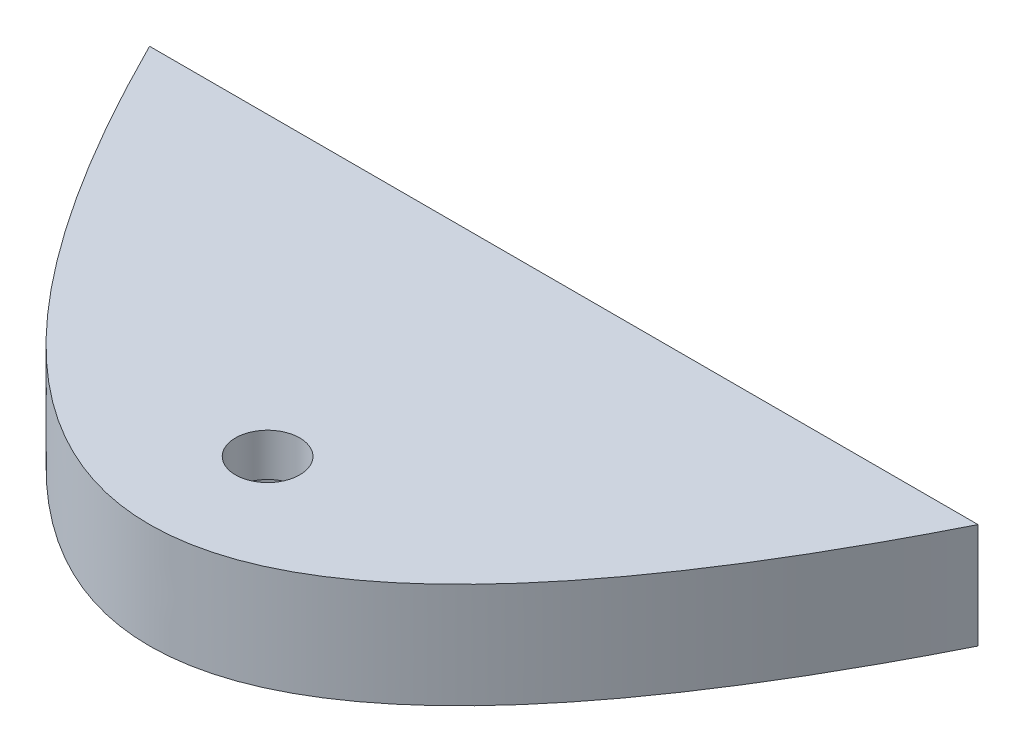
ISO-10303-21;
HEADER;
FILE_DESCRIPTION(('STEP AP214'),'2;1');
FILE_NAME('part.step','',(''),(''),'','','');
FILE_SCHEMA(('AUTOMOTIVE_DESIGN { 1 0 10303 214 1 1 1 1 }'));
ENDSEC;
DATA;
#1=APPLICATION_CONTEXT('core data for automotive mechanical design processes');
#2=APPLICATION_PROTOCOL_DEFINITION('international standard','automotive_design',2000,#1);
#3=PRODUCT_CONTEXT('',#1,'mechanical');
#4=PRODUCT('Part','Part','',(#3));
#5=PRODUCT_RELATED_PRODUCT_CATEGORY('part','',(#4));
#6=PRODUCT_DEFINITION_FORMATION('','',#4);
#7=PRODUCT_DEFINITION_CONTEXT('part definition',#1,'design');
#8=PRODUCT_DEFINITION('design','',#6,#7);
#9=PRODUCT_DEFINITION_SHAPE('','',#8);
#10=(LENGTH_UNIT() NAMED_UNIT(*) SI_UNIT(.MILLI.,.METRE.));
#11=(NAMED_UNIT(*) PLANE_ANGLE_UNIT() SI_UNIT($,.RADIAN.));
#12=(NAMED_UNIT(*) SI_UNIT($,.STERADIAN.) SOLID_ANGLE_UNIT());
#13=UNCERTAINTY_MEASURE_WITH_UNIT(LENGTH_MEASURE(1.E-05),#10,'distance_accuracy_value','');
#14=(GEOMETRIC_REPRESENTATION_CONTEXT(3) GLOBAL_UNCERTAINTY_ASSIGNED_CONTEXT((#13)) GLOBAL_UNIT_ASSIGNED_CONTEXT((#10,
#11,#12)) REPRESENTATION_CONTEXT('',''));
#15=CARTESIAN_POINT('',(0.,0.,0.));
#16=DIRECTION('',(0.,0.,1.));
#17=DIRECTION('',(1.,0.,0.));
#18=AXIS2_PLACEMENT_3D('',#15,#16,#17);
#19=CARTESIAN_POINT('',(0.,173.,142.999999999465));
#20=DIRECTION('',(0.,-1.,0.));
#21=DIRECTION('',(0.,0.,-1.));
#22=AXIS2_PLACEMENT_3D('',#19,#20,#21);
#23=CYLINDRICAL_SURFACE('',#22,15.5);
#24=CARTESIAN_POINT('',(0.,147.6,142.999999999465));
#25=DIRECTION('',(0.,-1.,0.));
#26=DIRECTION('',(0.,0.,-1.));
#27=AXIS2_PLACEMENT_3D('',#24,#25,#26);
#28=CIRCLE('',#27,15.5);
#29=CARTESIAN_POINT('',(0.,147.6,127.499999999465));
#30=VERTEX_POINT('',#29);
#31=EDGE_CURVE('E75',#30,#30,#28,.T.);
#32=ORIENTED_EDGE('',*,*,#31,.F.);
#33=EDGE_LOOP('',(#32));
#34=FACE_BOUND('',#33,.T.);
#35=CARTESIAN_POINT('',(0.,127.,142.999999999465));
#36=DIRECTION('',(0.,-1.,0.));
#37=DIRECTION('',(0.,0.,-1.));
#38=AXIS2_PLACEMENT_3D('',#35,#36,#37);
#39=CIRCLE('',#38,15.5);
#40=CARTESIAN_POINT('',(0.,127.,127.499999999465));
#41=VERTEX_POINT('',#40);
#42=EDGE_CURVE('E90',#41,#41,#39,.T.);
#43=ORIENTED_EDGE('',*,*,#42,.T.);
#44=EDGE_LOOP('',(#43));
#45=FACE_BOUND('',#44,.T.);
#46=ADVANCED_FACE('F35',(#34,#45),#23,.F.);
#47=CARTESIAN_POINT('',(-200.000000000337,300.,-6.70196537155832E-10));
#48=CARTESIAN_POINT('',(-5.91540705308091E-11,300.,400.000000000552));
#49=CARTESIAN_POINT('',(200.000000000219,300.,-4.34305369445553E-10));
#50=B_SPLINE_CURVE_WITH_KNOTS('',2,(#47,#48,#49),.UNSPECIFIED.,.F.,.F.,(3,3),(0.056028396232078,
0.943971603767659),.UNSPECIFIED.);
#51=DIRECTION('',(0.,-1.,0.));
#52=VECTOR('',#51,1.);
#53=SURFACE_OF_LINEAR_EXTRUSION('',#50,#52);
#54=DIRECTION('',(0.,-1.,0.));
#55=VECTOR('',#54,1.);
#56=CARTESIAN_POINT('',(-200.00000000027,300.,-5.35238059385865E-10));
#57=LINE('',#56,#55);
#58=CARTESIAN_POINT('',(-200.00000000027,147.6,0.));
#59=VERTEX_POINT('',#58);
#60=CARTESIAN_POINT('',(-200.00000000027,96.8,-5.35238059385865E-10));
#61=VERTEX_POINT('',#60);
#62=EDGE_CURVE('E45',#59,#61,#57,.T.);
#63=ORIENTED_EDGE('',*,*,#62,.T.);
#64=CARTESIAN_POINT('',(-200.000000000337,96.8000000000001,-6.70196537155832E-10));
#65=CARTESIAN_POINT('',(-5.91540705308091E-11,96.8000000000001,400.000000000552));
#66=CARTESIAN_POINT('',(200.000000000219,96.8000000000001,-4.34305369445553E-10));
#67=B_SPLINE_CURVE_WITH_KNOTS('',2,(#64,#65,#66),.UNSPECIFIED.,.F.,.F.,(3,3),(0.056028396232078,
0.943971603767659),.UNSPECIFIED.);
#68=CARTESIAN_POINT('',(200.000000000156,96.8,0.));
#69=VERTEX_POINT('',#68);
#70=EDGE_CURVE('E51',#61,#69,#67,.T.);
#71=ORIENTED_EDGE('',*,*,#70,.T.);
#72=DIRECTION('',(0.,-1.,0.));
#73=VECTOR('',#72,1.);
#74=CARTESIAN_POINT('',(200.000000000156,300.,-5.35238059385865E-10));
#75=LINE('',#74,#73);
#76=CARTESIAN_POINT('',(200.000000000156,147.6,-5.35238059385865E-10));
#77=VERTEX_POINT('',#76);
#78=EDGE_CURVE('E11',#77,#69,#75,.T.);
#79=ORIENTED_EDGE('',*,*,#78,.F.);
#80=CARTESIAN_POINT('',(-200.000000000337,147.6,-6.70196537155832E-10));
#81=CARTESIAN_POINT('',(-5.91540705308091E-11,147.6,400.000000000552));
#82=CARTESIAN_POINT('',(200.000000000219,147.6,-4.34305369445553E-10));
#83=B_SPLINE_CURVE_WITH_KNOTS('',2,(#80,#81,#82),.UNSPECIFIED.,.F.,.F.,(3,3),(0.056028396232078,
0.943971603767659),.UNSPECIFIED.);
#84=EDGE_CURVE('E58',#77,#59,#83,.F.);
#85=ORIENTED_EDGE('',*,*,#84,.T.);
#86=EDGE_LOOP('',(#63,#71,#79,#85));
#87=FACE_BOUND('',#86,.T.);
#88=ADVANCED_FACE('F37',(#87),#53,.F.);
#89=CARTESIAN_POINT('',(-200.00000000027,300.,-5.35238059385865E-10));
#90=DIRECTION('',(0.,0.,1.));
#91=DIRECTION('',(1.,0.,0.));
#92=AXIS2_PLACEMENT_3D('',#89,#90,#91);
#93=PLANE('',#92);
#94=ORIENTED_EDGE('',*,*,#78,.T.);
#95=DIRECTION('',(1.,0.,0.));
#96=VECTOR('',#95,1.);
#97=CARTESIAN_POINT('',(245.431849583719,96.8,0.));
#98=LINE('',#97,#96);
#99=EDGE_CURVE('E69',#61,#69,#98,.T.);
#100=ORIENTED_EDGE('',*,*,#99,.F.);
#101=ORIENTED_EDGE('',*,*,#62,.F.);
#102=DIRECTION('',(-1.,0.,0.));
#103=VECTOR('',#102,1.);
#104=CARTESIAN_POINT('',(245.431849583719,147.6,0.));
#105=LINE('',#104,#103);
#106=EDGE_CURVE('E67',#77,#59,#105,.T.);
#107=ORIENTED_EDGE('',*,*,#106,.F.);
#108=EDGE_LOOP('',(#94,#100,#101,#107));
#109=FACE_BOUND('',#108,.T.);
#110=ADVANCED_FACE('F73',(#109),#93,.F.);
#111=CARTESIAN_POINT('',(0.,-173.,142.999999999465));
#112=DIRECTION('',(0.,1.,0.));
#113=DIRECTION('',(0.,0.,1.));
#114=AXIS2_PLACEMENT_3D('',#111,#112,#113);
#115=CYLINDRICAL_SURFACE('',#114,35.);
#116=CARTESIAN_POINT('',(0.,96.8,142.999999999465));
#117=DIRECTION('',(0.,1.,0.));
#118=DIRECTION('',(0.,0.,1.));
#119=AXIS2_PLACEMENT_3D('',#116,#117,#118);
#120=CIRCLE('',#119,35.);
#121=CARTESIAN_POINT('',(0.,96.8,177.999999999465));
#122=VERTEX_POINT('',#121);
#123=EDGE_CURVE('E40',#122,#122,#120,.F.);
#124=ORIENTED_EDGE('',*,*,#123,.T.);
#125=EDGE_LOOP('',(#124));
#126=FACE_BOUND('',#125,.T.);
#127=CARTESIAN_POINT('',(0.,127.,142.999999999465));
#128=DIRECTION('',(0.,1.,0.));
#129=DIRECTION('',(0.,0.,1.));
#130=AXIS2_PLACEMENT_3D('',#127,#128,#129);
#131=CIRCLE('',#130,35.);
#132=CARTESIAN_POINT('',(0.,127.,177.999999999465));
#133=VERTEX_POINT('',#132);
#134=EDGE_CURVE('E87',#133,#133,#131,.T.);
#135=ORIENTED_EDGE('',*,*,#134,.T.);
#136=EDGE_LOOP('',(#135));
#137=FACE_BOUND('',#136,.T.);
#138=ADVANCED_FACE('F106',(#126,#137),#115,.F.);
#139=CARTESIAN_POINT('',(0.,127.,142.999999999465));
#140=DIRECTION('',(0.,-1.,0.));
#141=DIRECTION('',(0.,0.,1.));
#142=AXIS2_PLACEMENT_3D('',#139,#140,#141);
#143=PLANE('',#142);
#144=ORIENTED_EDGE('',*,*,#42,.F.);
#145=EDGE_LOOP('',(#144));
#146=FACE_BOUND('',#145,.T.);
#147=ORIENTED_EDGE('',*,*,#134,.F.);
#148=EDGE_LOOP('',(#147));
#149=FACE_BOUND('',#148,.T.);
#150=ADVANCED_FACE('F102',(#146,#149),#143,.T.);
#151=CARTESIAN_POINT('',(245.431849583719,147.6,200.000000000059));
#152=DIRECTION('',(0.,-1.,0.));
#153=DIRECTION('',(0.,0.,-1.));
#154=AXIS2_PLACEMENT_3D('',#151,#152,#153);
#155=PLANE('',#154);
#156=ORIENTED_EDGE('',*,*,#31,.T.);
#157=EDGE_LOOP('',(#156));
#158=FACE_BOUND('',#157,.T.);
#159=ORIENTED_EDGE('',*,*,#106,.T.);
#160=ORIENTED_EDGE('',*,*,#84,.F.);
#161=EDGE_LOOP('',(#159,#160));
#162=FACE_BOUND('',#161,.T.);
#163=ADVANCED_FACE('F105',(#158,#162),#155,.F.);
#164=CARTESIAN_POINT('',(245.431849583719,96.8,200.000000000059));
#165=DIRECTION('',(0.,1.,0.));
#166=DIRECTION('',(0.,0.,1.));
#167=AXIS2_PLACEMENT_3D('',#164,#165,#166);
#168=PLANE('',#167);
#169=ORIENTED_EDGE('',*,*,#123,.F.);
#170=EDGE_LOOP('',(#169));
#171=FACE_BOUND('',#170,.T.);
#172=ORIENTED_EDGE('',*,*,#99,.T.);
#173=ORIENTED_EDGE('',*,*,#70,.F.);
#174=EDGE_LOOP('',(#172,#173));
#175=FACE_BOUND('',#174,.T.);
#176=ADVANCED_FACE('F70',(#171,#175),#168,.F.);
#177=CLOSED_SHELL('',(#46,#88,#110,#138,#150,#163,#176));
#178=MANIFOLD_SOLID_BREP('B2',#177);
#179=ADVANCED_BREP_SHAPE_REPRESENTATION('',(#18,#178),#14);
#180=SHAPE_DEFINITION_REPRESENTATION(#9,#179);
ENDSEC;
END-ISO-10303-21;
